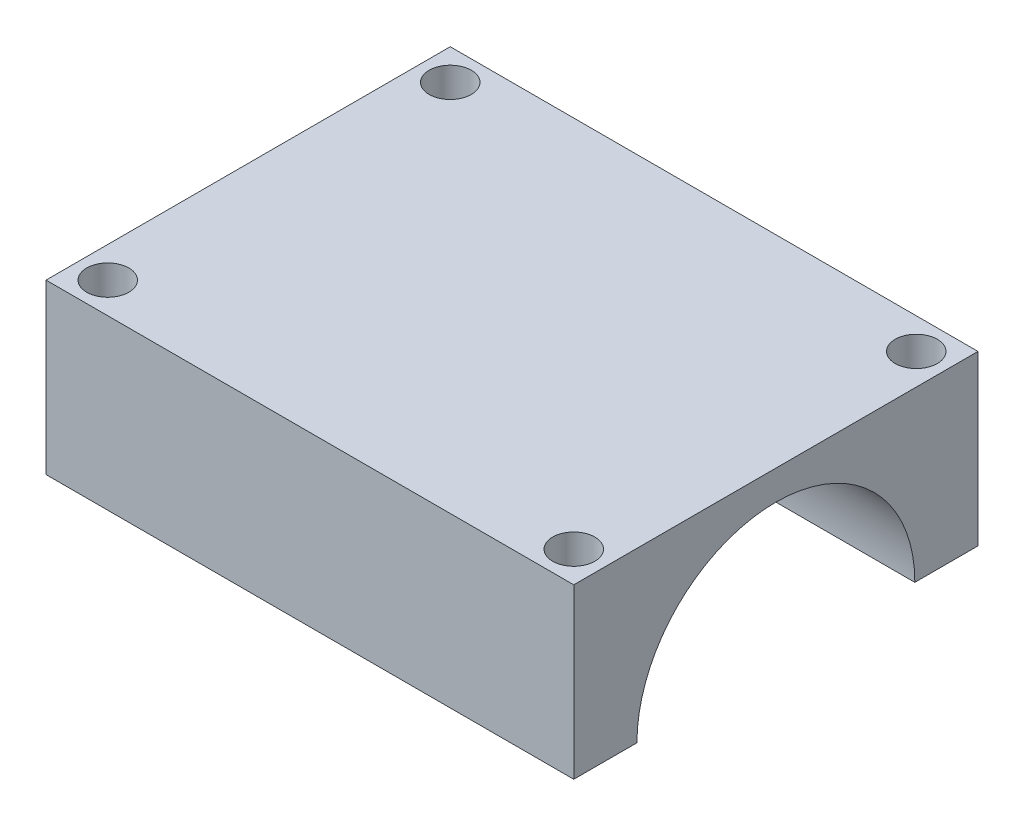
ISO-10303-21;
HEADER;
FILE_DESCRIPTION(('STEP AP214'),'2;1');
FILE_NAME('part.step','',(''),(''),'','','');
FILE_SCHEMA(('AUTOMOTIVE_DESIGN { 1 0 10303 214 1 1 1 1 }'));
ENDSEC;
DATA;
#1=APPLICATION_CONTEXT('core data for automotive mechanical design processes');
#2=APPLICATION_PROTOCOL_DEFINITION('international standard','automotive_design',2000,#1);
#3=PRODUCT_CONTEXT('',#1,'mechanical');
#4=PRODUCT('Part','Part','',(#3));
#5=PRODUCT_RELATED_PRODUCT_CATEGORY('part','',(#4));
#6=PRODUCT_DEFINITION_FORMATION('','',#4);
#7=PRODUCT_DEFINITION_CONTEXT('part definition',#1,'design');
#8=PRODUCT_DEFINITION('design','',#6,#7);
#9=PRODUCT_DEFINITION_SHAPE('','',#8);
#10=(LENGTH_UNIT() NAMED_UNIT(*) SI_UNIT(.MILLI.,.METRE.));
#11=(NAMED_UNIT(*) PLANE_ANGLE_UNIT() SI_UNIT($,.RADIAN.));
#12=(NAMED_UNIT(*) SI_UNIT($,.STERADIAN.) SOLID_ANGLE_UNIT());
#13=UNCERTAINTY_MEASURE_WITH_UNIT(LENGTH_MEASURE(1.E-05),#10,'distance_accuracy_value','');
#14=(GEOMETRIC_REPRESENTATION_CONTEXT(3) GLOBAL_UNCERTAINTY_ASSIGNED_CONTEXT((#13)) GLOBAL_UNIT_ASSIGNED_CONTEXT((#10,
#11,#12)) REPRESENTATION_CONTEXT('',''));
#15=CARTESIAN_POINT('',(0.,0.,0.));
#16=DIRECTION('',(0.,0.,1.));
#17=DIRECTION('',(1.,0.,0.));
#18=AXIS2_PLACEMENT_3D('',#15,#16,#17);
#19=CARTESIAN_POINT('',(23.5,30.,18.));
#20=DIRECTION('',(-1.,0.,0.));
#21=DIRECTION('',(0.,0.,1.));
#22=AXIS2_PLACEMENT_3D('',#19,#20,#21);
#23=PLANE('',#22);
#24=DIRECTION('',(0.,-1.,0.));
#25=VECTOR('',#24,1.);
#26=CARTESIAN_POINT('',(23.5,30.,18.));
#27=LINE('',#26,#25);
#28=CARTESIAN_POINT('',(23.5,30.,18.));
#29=VERTEX_POINT('',#28);
#30=CARTESIAN_POINT('',(23.5,15.,18.));
#31=VERTEX_POINT('',#30);
#32=EDGE_CURVE('E129',#29,#31,#27,.T.);
#33=ORIENTED_EDGE('',*,*,#32,.T.);
#34=DIRECTION('',(0.,0.,1.));
#35=VECTOR('',#34,1.);
#36=CARTESIAN_POINT('',(23.5,15.,18.));
#37=LINE('',#36,#35);
#38=CARTESIAN_POINT('',(23.5,15.,12.375));
#39=VERTEX_POINT('',#38);
#40=EDGE_CURVE('E104',#39,#31,#37,.T.);
#41=ORIENTED_EDGE('',*,*,#40,.F.);
#42=CARTESIAN_POINT('',(23.5,15.,0.));
#43=DIRECTION('',(1.,0.,0.));
#44=DIRECTION('',(0.,0.,-1.));
#45=AXIS2_PLACEMENT_3D('',#42,#43,#44);
#46=CIRCLE('',#45,12.375);
#47=CARTESIAN_POINT('',(23.5,15.,-12.375));
#48=VERTEX_POINT('',#47);
#49=EDGE_CURVE('E148',#48,#39,#46,.T.);
#50=ORIENTED_EDGE('',*,*,#49,.F.);
#51=CARTESIAN_POINT('',(23.5,15.,-18.));
#52=VERTEX_POINT('',#51);
#53=EDGE_CURVE('E65',#52,#48,#37,.T.);
#54=ORIENTED_EDGE('',*,*,#53,.F.);
#55=DIRECTION('',(0.,-1.,0.));
#56=VECTOR('',#55,1.);
#57=CARTESIAN_POINT('',(23.5,30.,-18.));
#58=LINE('',#57,#56);
#59=CARTESIAN_POINT('',(23.5,30.,-18.));
#60=VERTEX_POINT('',#59);
#61=EDGE_CURVE('E11',#60,#52,#58,.T.);
#62=ORIENTED_EDGE('',*,*,#61,.F.);
#63=DIRECTION('',(0.,0.,-1.));
#64=VECTOR('',#63,1.);
#65=CARTESIAN_POINT('',(23.5,30.,18.));
#66=LINE('',#65,#64);
#67=EDGE_CURVE('E144',#29,#60,#66,.T.);
#68=ORIENTED_EDGE('',*,*,#67,.F.);
#69=EDGE_LOOP('',(#33,#41,#50,#54,#62,#68));
#70=FACE_BOUND('',#69,.T.);
#71=ADVANCED_FACE('F49',(#70),#23,.F.);
#72=CARTESIAN_POINT('',(-23.5,30.,-18.));
#73=DIRECTION('',(0.,0.,1.));
#74=DIRECTION('',(1.,0.,0.));
#75=AXIS2_PLACEMENT_3D('',#72,#73,#74);
#76=PLANE('',#75);
#77=ORIENTED_EDGE('',*,*,#61,.T.);
#78=DIRECTION('',(1.,0.,0.));
#79=VECTOR('',#78,1.);
#80=CARTESIAN_POINT('',(-23.5,15.,-18.));
#81=LINE('',#80,#79);
#82=CARTESIAN_POINT('',(-23.5,15.,-18.));
#83=VERTEX_POINT('',#82);
#84=EDGE_CURVE('E110',#83,#52,#81,.T.);
#85=ORIENTED_EDGE('',*,*,#84,.F.);
#86=DIRECTION('',(0.,-1.,0.));
#87=VECTOR('',#86,1.);
#88=CARTESIAN_POINT('',(-23.5,30.,-18.));
#89=LINE('',#88,#87);
#90=CARTESIAN_POINT('',(-23.5,30.,-18.));
#91=VERTEX_POINT('',#90);
#92=EDGE_CURVE('E58',#91,#83,#89,.T.);
#93=ORIENTED_EDGE('',*,*,#92,.F.);
#94=DIRECTION('',(-1.,0.,0.));
#95=VECTOR('',#94,1.);
#96=CARTESIAN_POINT('',(-23.5,30.,-18.));
#97=LINE('',#96,#95);
#98=EDGE_CURVE('E141',#60,#91,#97,.T.);
#99=ORIENTED_EDGE('',*,*,#98,.F.);
#100=EDGE_LOOP('',(#77,#85,#93,#99));
#101=FACE_BOUND('',#100,.T.);
#102=ADVANCED_FACE('F204',(#101),#76,.F.);
#103=CARTESIAN_POINT('',(-23.5,30.,18.));
#104=DIRECTION('',(1.,0.,0.));
#105=DIRECTION('',(0.,0.,-1.));
#106=AXIS2_PLACEMENT_3D('',#103,#104,#105);
#107=PLANE('',#106);
#108=ORIENTED_EDGE('',*,*,#92,.T.);
#109=DIRECTION('',(0.,0.,1.));
#110=VECTOR('',#109,1.);
#111=CARTESIAN_POINT('',(-23.5,15.,18.));
#112=LINE('',#111,#110);
#113=CARTESIAN_POINT('',(-23.5,15.,-12.375));
#114=VERTEX_POINT('',#113);
#115=EDGE_CURVE('E111',#83,#114,#112,.T.);
#116=ORIENTED_EDGE('',*,*,#115,.T.);
#117=CARTESIAN_POINT('',(-23.5,15.,0.));
#118=DIRECTION('',(1.,0.,0.));
#119=DIRECTION('',(0.,0.,-1.));
#120=AXIS2_PLACEMENT_3D('',#117,#118,#119);
#121=CIRCLE('',#120,12.375);
#122=CARTESIAN_POINT('',(-23.5,15.,12.375));
#123=VERTEX_POINT('',#122);
#124=EDGE_CURVE('E123',#114,#123,#121,.T.);
#125=ORIENTED_EDGE('',*,*,#124,.T.);
#126=CARTESIAN_POINT('',(-23.5,15.,18.));
#127=VERTEX_POINT('',#126);
#128=EDGE_CURVE('E73',#123,#127,#112,.T.);
#129=ORIENTED_EDGE('',*,*,#128,.T.);
#130=DIRECTION('',(0.,-1.,0.));
#131=VECTOR('',#130,1.);
#132=CARTESIAN_POINT('',(-23.5,30.,18.));
#133=LINE('',#132,#131);
#134=CARTESIAN_POINT('',(-23.5,30.,18.));
#135=VERTEX_POINT('',#134);
#136=EDGE_CURVE('E119',#135,#127,#133,.T.);
#137=ORIENTED_EDGE('',*,*,#136,.F.);
#138=DIRECTION('',(0.,0.,1.));
#139=VECTOR('',#138,1.);
#140=CARTESIAN_POINT('',(-23.5,30.,18.));
#141=LINE('',#140,#139);
#142=EDGE_CURVE('E138',#91,#135,#141,.T.);
#143=ORIENTED_EDGE('',*,*,#142,.F.);
#144=EDGE_LOOP('',(#108,#116,#125,#129,#137,#143));
#145=FACE_BOUND('',#144,.T.);
#146=ADVANCED_FACE('F117',(#145),#107,.F.);
#147=CARTESIAN_POINT('',(-23.5,30.,18.));
#148=DIRECTION('',(0.,0.,-1.));
#149=DIRECTION('',(-1.,0.,0.));
#150=AXIS2_PLACEMENT_3D('',#147,#148,#149);
#151=PLANE('',#150);
#152=ORIENTED_EDGE('',*,*,#136,.T.);
#153=DIRECTION('',(1.,0.,0.));
#154=VECTOR('',#153,1.);
#155=CARTESIAN_POINT('',(-23.5,15.,18.));
#156=LINE('',#155,#154);
#157=EDGE_CURVE('E101',#127,#31,#156,.T.);
#158=ORIENTED_EDGE('',*,*,#157,.T.);
#159=ORIENTED_EDGE('',*,*,#32,.F.);
#160=DIRECTION('',(1.,0.,0.));
#161=VECTOR('',#160,1.);
#162=CARTESIAN_POINT('',(-23.5,30.,18.));
#163=LINE('',#162,#161);
#164=EDGE_CURVE('E127',#135,#29,#163,.T.);
#165=ORIENTED_EDGE('',*,*,#164,.F.);
#166=EDGE_LOOP('',(#152,#158,#159,#165));
#167=FACE_BOUND('',#166,.T.);
#168=ADVANCED_FACE('F126',(#167),#151,.F.);
#169=CARTESIAN_POINT('',(0.,30.,0.));
#170=DIRECTION('',(0.,-1.,0.));
#171=DIRECTION('',(0.,0.,-1.));
#172=AXIS2_PLACEMENT_3D('',#169,#170,#171);
#173=PLANE('',#172);
#174=CARTESIAN_POINT('',(20.75,30.,-15.25));
#175=DIRECTION('',(0.,1.,0.));
#176=DIRECTION('',(0.,0.,-1.));
#177=AXIS2_PLACEMENT_3D('',#174,#175,#176);
#178=CIRCLE('',#177,1.875);
#179=CARTESIAN_POINT('',(20.75,30.,-17.125));
#180=VERTEX_POINT('',#179);
#181=EDGE_CURVE('E159',#180,#180,#178,.T.);
#182=ORIENTED_EDGE('',*,*,#181,.F.);
#183=EDGE_LOOP('',(#182));
#184=FACE_BOUND('',#183,.T.);
#185=CARTESIAN_POINT('',(20.75,30.,15.25));
#186=DIRECTION('',(0.,1.,0.));
#187=DIRECTION('',(0.,0.,1.));
#188=AXIS2_PLACEMENT_3D('',#185,#186,#187);
#189=CIRCLE('',#188,1.875);
#190=CARTESIAN_POINT('',(20.75,30.,17.125));
#191=VERTEX_POINT('',#190);
#192=EDGE_CURVE('E163',#191,#191,#189,.T.);
#193=ORIENTED_EDGE('',*,*,#192,.F.);
#194=EDGE_LOOP('',(#193));
#195=FACE_BOUND('',#194,.T.);
#196=CARTESIAN_POINT('',(-20.75,30.,15.25));
#197=DIRECTION('',(0.,1.,0.));
#198=DIRECTION('',(0.,0.,-1.));
#199=AXIS2_PLACEMENT_3D('',#196,#197,#198);
#200=CIRCLE('',#199,1.875);
#201=CARTESIAN_POINT('',(-20.75,30.,13.375));
#202=VERTEX_POINT('',#201);
#203=EDGE_CURVE('E158',#202,#202,#200,.T.);
#204=ORIENTED_EDGE('',*,*,#203,.F.);
#205=EDGE_LOOP('',(#204));
#206=FACE_BOUND('',#205,.T.);
#207=CARTESIAN_POINT('',(-20.75,30.,-15.25));
#208=DIRECTION('',(0.,1.,0.));
#209=DIRECTION('',(0.,0.,1.));
#210=AXIS2_PLACEMENT_3D('',#207,#208,#209);
#211=CIRCLE('',#210,1.875);
#212=CARTESIAN_POINT('',(-20.75,30.,-13.375));
#213=VERTEX_POINT('',#212);
#214=EDGE_CURVE('E152',#213,#213,#211,.T.);
#215=ORIENTED_EDGE('',*,*,#214,.F.);
#216=EDGE_LOOP('',(#215));
#217=FACE_BOUND('',#216,.T.);
#218=ORIENTED_EDGE('',*,*,#67,.T.);
#219=ORIENTED_EDGE('',*,*,#98,.T.);
#220=ORIENTED_EDGE('',*,*,#142,.T.);
#221=ORIENTED_EDGE('',*,*,#164,.T.);
#222=EDGE_LOOP('',(#218,#219,#220,#221));
#223=FACE_BOUND('',#222,.T.);
#224=ADVANCED_FACE('F202',(#184,#195,#206,#217,#223),#173,.F.);
#225=CARTESIAN_POINT('',(-23.5,15.,0.));
#226=DIRECTION('',(1.,0.,0.));
#227=DIRECTION('',(0.,0.,-1.));
#228=AXIS2_PLACEMENT_3D('',#225,#226,#227);
#229=CYLINDRICAL_SURFACE('',#228,12.375);
#230=ORIENTED_EDGE('',*,*,#49,.T.);
#231=DIRECTION('',(1.,0.,0.));
#232=VECTOR('',#231,1.);
#233=CARTESIAN_POINT('',(-23.5,15.,12.375));
#234=LINE('',#233,#232);
#235=EDGE_CURVE('E164',#39,#123,#234,.F.);
#236=ORIENTED_EDGE('',*,*,#235,.T.);
#237=ORIENTED_EDGE('',*,*,#124,.F.);
#238=DIRECTION('',(1.,0.,0.));
#239=VECTOR('',#238,1.);
#240=CARTESIAN_POINT('',(-23.5,15.,-12.375));
#241=LINE('',#240,#239);
#242=EDGE_CURVE('E173',#114,#48,#241,.T.);
#243=ORIENTED_EDGE('',*,*,#242,.T.);
#244=EDGE_LOOP('',(#230,#236,#237,#243));
#245=FACE_BOUND('',#244,.T.);
#246=ADVANCED_FACE('F195',(#245),#229,.F.);
#247=CARTESIAN_POINT('',(-20.75,-10.,-15.25));
#248=DIRECTION('',(0.,1.,0.));
#249=DIRECTION('',(0.,0.,1.));
#250=AXIS2_PLACEMENT_3D('',#247,#248,#249);
#251=CYLINDRICAL_SURFACE('',#250,1.875);
#252=CARTESIAN_POINT('',(-20.75,15.,-15.25));
#253=DIRECTION('',(0.,1.,0.));
#254=DIRECTION('',(0.,0.,1.));
#255=AXIS2_PLACEMENT_3D('',#252,#253,#254);
#256=CIRCLE('',#255,1.875);
#257=CARTESIAN_POINT('',(-20.75,15.,-13.375));
#258=VERTEX_POINT('',#257);
#259=EDGE_CURVE('E176',#258,#258,#256,.F.);
#260=ORIENTED_EDGE('',*,*,#259,.T.);
#261=EDGE_LOOP('',(#260));
#262=FACE_BOUND('',#261,.T.);
#263=ORIENTED_EDGE('',*,*,#214,.T.);
#264=EDGE_LOOP('',(#263));
#265=FACE_BOUND('',#264,.T.);
#266=ADVANCED_FACE('F237',(#262,#265),#251,.F.);
#267=CARTESIAN_POINT('',(-20.75,-10.,15.25));
#268=DIRECTION('',(0.,1.,0.));
#269=DIRECTION('',(0.,0.,1.));
#270=AXIS2_PLACEMENT_3D('',#267,#268,#269);
#271=CYLINDRICAL_SURFACE('',#270,1.875);
#272=CARTESIAN_POINT('',(-20.75,15.,15.25));
#273=DIRECTION('',(0.,1.,0.));
#274=DIRECTION('',(0.,0.,1.));
#275=AXIS2_PLACEMENT_3D('',#272,#273,#274);
#276=CIRCLE('',#275,1.875);
#277=CARTESIAN_POINT('',(-20.75,15.,17.125));
#278=VERTEX_POINT('',#277);
#279=EDGE_CURVE('E180',#278,#278,#276,.F.);
#280=ORIENTED_EDGE('',*,*,#279,.T.);
#281=EDGE_LOOP('',(#280));
#282=FACE_BOUND('',#281,.T.);
#283=ORIENTED_EDGE('',*,*,#203,.T.);
#284=EDGE_LOOP('',(#283));
#285=FACE_BOUND('',#284,.T.);
#286=ADVANCED_FACE('F239',(#282,#285),#271,.F.);
#287=CARTESIAN_POINT('',(20.75,-10.,15.25));
#288=DIRECTION('',(0.,1.,0.));
#289=DIRECTION('',(0.,0.,1.));
#290=AXIS2_PLACEMENT_3D('',#287,#288,#289);
#291=CYLINDRICAL_SURFACE('',#290,1.875);
#292=CARTESIAN_POINT('',(20.75,15.,15.25));
#293=DIRECTION('',(0.,1.,0.));
#294=DIRECTION('',(0.,0.,1.));
#295=AXIS2_PLACEMENT_3D('',#292,#293,#294);
#296=CIRCLE('',#295,1.875);
#297=CARTESIAN_POINT('',(20.75,15.,17.125));
#298=VERTEX_POINT('',#297);
#299=EDGE_CURVE('E184',#298,#298,#296,.F.);
#300=ORIENTED_EDGE('',*,*,#299,.T.);
#301=EDGE_LOOP('',(#300));
#302=FACE_BOUND('',#301,.T.);
#303=ORIENTED_EDGE('',*,*,#192,.T.);
#304=EDGE_LOOP('',(#303));
#305=FACE_BOUND('',#304,.T.);
#306=ADVANCED_FACE('F215',(#302,#305),#291,.F.);
#307=CARTESIAN_POINT('',(20.75,-10.,-15.25));
#308=DIRECTION('',(0.,1.,0.));
#309=DIRECTION('',(0.,0.,1.));
#310=AXIS2_PLACEMENT_3D('',#307,#308,#309);
#311=CYLINDRICAL_SURFACE('',#310,1.875);
#312=CARTESIAN_POINT('',(20.75,15.,-15.25));
#313=DIRECTION('',(0.,1.,0.));
#314=DIRECTION('',(0.,0.,1.));
#315=AXIS2_PLACEMENT_3D('',#312,#313,#314);
#316=CIRCLE('',#315,1.875);
#317=CARTESIAN_POINT('',(20.75,15.,-13.375));
#318=VERTEX_POINT('',#317);
#319=EDGE_CURVE('E52',#318,#318,#316,.F.);
#320=ORIENTED_EDGE('',*,*,#319,.T.);
#321=EDGE_LOOP('',(#320));
#322=FACE_BOUND('',#321,.T.);
#323=ORIENTED_EDGE('',*,*,#181,.T.);
#324=EDGE_LOOP('',(#323));
#325=FACE_BOUND('',#324,.T.);
#326=ADVANCED_FACE('F207',(#322,#325),#311,.F.);
#327=CARTESIAN_POINT('',(-23.5,15.,18.));
#328=DIRECTION('',(0.,1.,0.));
#329=DIRECTION('',(0.,0.,1.));
#330=AXIS2_PLACEMENT_3D('',#327,#328,#329);
#331=PLANE('',#330);
#332=ORIENTED_EDGE('',*,*,#259,.F.);
#333=EDGE_LOOP('',(#332));
#334=FACE_BOUND('',#333,.T.);
#335=ORIENTED_EDGE('',*,*,#319,.F.);
#336=EDGE_LOOP('',(#335));
#337=FACE_BOUND('',#336,.T.);
#338=ORIENTED_EDGE('',*,*,#115,.F.);
#339=ORIENTED_EDGE('',*,*,#84,.T.);
#340=ORIENTED_EDGE('',*,*,#53,.T.);
#341=ORIENTED_EDGE('',*,*,#242,.F.);
#342=EDGE_LOOP('',(#338,#339,#340,#341));
#343=FACE_BOUND('',#342,.T.);
#344=ADVANCED_FACE('F205',(#334,#337,#343),#331,.F.);
#345=ORIENTED_EDGE('',*,*,#279,.F.);
#346=EDGE_LOOP('',(#345));
#347=FACE_BOUND('',#346,.T.);
#348=ORIENTED_EDGE('',*,*,#299,.F.);
#349=EDGE_LOOP('',(#348));
#350=FACE_BOUND('',#349,.T.);
#351=ORIENTED_EDGE('',*,*,#40,.T.);
#352=ORIENTED_EDGE('',*,*,#157,.F.);
#353=ORIENTED_EDGE('',*,*,#128,.F.);
#354=ORIENTED_EDGE('',*,*,#235,.F.);
#355=EDGE_LOOP('',(#351,#352,#353,#354));
#356=FACE_BOUND('',#355,.T.);
#357=ADVANCED_FACE('F102',(#347,#350,#356),#331,.F.);
#358=CLOSED_SHELL('',(#71,#102,#146,#168,#224,#246,#266,#286,#306,#326,#344,#357));
#359=MANIFOLD_SOLID_BREP('B2',#358);
#360=ADVANCED_BREP_SHAPE_REPRESENTATION('',(#18,#359),#14);
#361=SHAPE_DEFINITION_REPRESENTATION(#9,#360);
ENDSEC;
END-ISO-10303-21;
